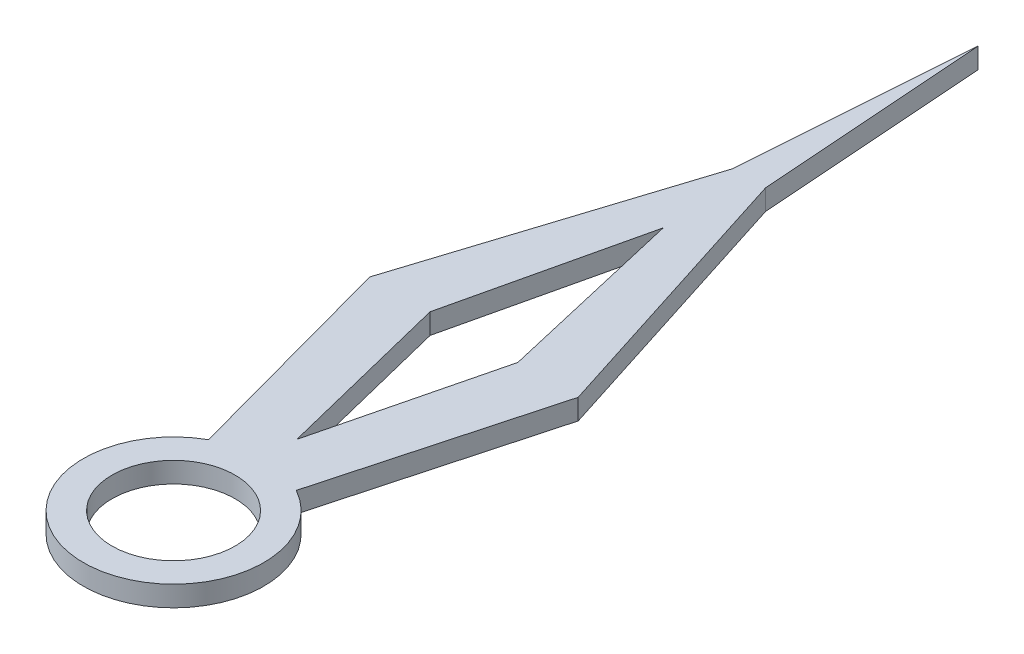
ISO-10303-21;
HEADER;
FILE_DESCRIPTION(('STEP AP214'),'2;1');
FILE_NAME('part.step','',(''),(''),'','','');
FILE_SCHEMA(('AUTOMOTIVE_DESIGN { 1 0 10303 214 1 1 1 1 }'));
ENDSEC;
DATA;
#1=APPLICATION_CONTEXT('core data for automotive mechanical design processes');
#2=APPLICATION_PROTOCOL_DEFINITION('international standard','automotive_design',2000,#1);
#3=PRODUCT_CONTEXT('',#1,'mechanical');
#4=PRODUCT('Part','Part','',(#3));
#5=PRODUCT_RELATED_PRODUCT_CATEGORY('part','',(#4));
#6=PRODUCT_DEFINITION_FORMATION('','',#4);
#7=PRODUCT_DEFINITION_CONTEXT('part definition',#1,'design');
#8=PRODUCT_DEFINITION('design','',#6,#7);
#9=PRODUCT_DEFINITION_SHAPE('','',#8);
#10=(LENGTH_UNIT() NAMED_UNIT(*) SI_UNIT(.MILLI.,.METRE.));
#11=(NAMED_UNIT(*) PLANE_ANGLE_UNIT() SI_UNIT($,.RADIAN.));
#12=(NAMED_UNIT(*) SI_UNIT($,.STERADIAN.) SOLID_ANGLE_UNIT());
#13=UNCERTAINTY_MEASURE_WITH_UNIT(LENGTH_MEASURE(1.E-05),#10,'distance_accuracy_value','');
#14=(GEOMETRIC_REPRESENTATION_CONTEXT(3) GLOBAL_UNCERTAINTY_ASSIGNED_CONTEXT((#13)) GLOBAL_UNIT_ASSIGNED_CONTEXT((#10,
#11,#12)) REPRESENTATION_CONTEXT('',''));
#15=CARTESIAN_POINT('',(0.,0.,0.));
#16=DIRECTION('',(0.,0.,1.));
#17=DIRECTION('',(1.,0.,0.));
#18=AXIS2_PLACEMENT_3D('',#15,#16,#17);
#19=CARTESIAN_POINT('',(-10.1750226421865,10.,2.77066259900445));
#20=DIRECTION('',(-0.964868301480339,0.,0.262734011499168));
#21=DIRECTION('',(0.262734011499168,0.,0.964868301480339));
#22=AXIS2_PLACEMENT_3D('',#19,#20,#21);
#23=PLANE('',#22);
#24=DIRECTION('',(-0.262734011499168,0.,-0.964868301480339));
#25=VECTOR('',#24,1.);
#26=CARTESIAN_POINT('',(-10.1750226421865,0.,2.77066259900445));
#27=LINE('',#26,#25);
#28=CARTESIAN_POINT('',(-21.3918568520725,0.,-38.4222066086182));
#29=VERTEX_POINT('',#28);
#30=CARTESIAN_POINT('',(-50.8100911545337,0.,-146.45816891895));
#31=VERTEX_POINT('',#30);
#32=EDGE_CURVE('E183',#29,#31,#27,.T.);
#33=ORIENTED_EDGE('',*,*,#32,.F.);
#34=DIRECTION('',(0.,-1.,0.));
#35=VECTOR('',#34,1.);
#36=CARTESIAN_POINT('',(-21.3918568520725,10.,-38.4222066086182));
#37=LINE('',#36,#35);
#38=CARTESIAN_POINT('',(-21.3918568520725,10.,-38.4222066086182));
#39=VERTEX_POINT('',#38);
#40=EDGE_CURVE('E11',#39,#29,#37,.T.);
#41=ORIENTED_EDGE('',*,*,#40,.F.);
#42=DIRECTION('',(-0.262734011499168,0.,-0.964868301480339));
#43=VECTOR('',#42,1.);
#44=CARTESIAN_POINT('',(-10.1750226421865,10.,2.77066259900445));
#45=LINE('',#44,#43);
#46=CARTESIAN_POINT('',(-50.8100911545337,10.,-146.45816891895));
#47=VERTEX_POINT('',#46);
#48=EDGE_CURVE('E305',#39,#47,#45,.T.);
#49=ORIENTED_EDGE('',*,*,#48,.T.);
#50=DIRECTION('',(0.,-1.,0.));
#51=VECTOR('',#50,1.);
#52=CARTESIAN_POINT('',(-50.8100911545337,10.,-146.45816891895));
#53=LINE('',#52,#51);
#54=EDGE_CURVE('E61',#47,#31,#53,.T.);
#55=ORIENTED_EDGE('',*,*,#54,.T.);
#56=EDGE_LOOP('',(#33,#41,#49,#55));
#57=FACE_BOUND('',#56,.T.);
#58=ADVANCED_FACE('F41',(#57),#23,.T.);
#59=CARTESIAN_POINT('',(0.,10.,0.));
#60=DIRECTION('',(0.,-1.,0.));
#61=DIRECTION('',(0.,0.,-1.));
#62=AXIS2_PLACEMENT_3D('',#59,#60,#61);
#63=CYLINDRICAL_SURFACE('',#62,43.9758740703912);
#64=CARTESIAN_POINT('',(0.,0.,0.));
#65=DIRECTION('',(0.,1.,0.));
#66=DIRECTION('',(0.,0.,1.));
#67=AXIS2_PLACEMENT_3D('',#64,#65,#66);
#68=CIRCLE('',#67,43.9758740703912);
#69=CARTESIAN_POINT('',(21.3918568520725,0.,-38.4222066086182));
#70=VERTEX_POINT('',#69);
#71=EDGE_CURVE('E186',#29,#70,#68,.T.);
#72=ORIENTED_EDGE('',*,*,#71,.T.);
#73=DIRECTION('',(0.,-1.,0.));
#74=VECTOR('',#73,1.);
#75=CARTESIAN_POINT('',(21.3918568520725,10.,-38.4222066086182));
#76=LINE('',#75,#74);
#77=CARTESIAN_POINT('',(21.3918568520725,10.,-38.4222066086182));
#78=VERTEX_POINT('',#77);
#79=EDGE_CURVE('E52',#78,#70,#76,.T.);
#80=ORIENTED_EDGE('',*,*,#79,.F.);
#81=CARTESIAN_POINT('',(0.,10.,0.));
#82=DIRECTION('',(0.,1.,0.));
#83=DIRECTION('',(0.,0.,1.));
#84=AXIS2_PLACEMENT_3D('',#81,#82,#83);
#85=CIRCLE('',#84,43.9758740703912);
#86=EDGE_CURVE('E301',#39,#78,#85,.T.);
#87=ORIENTED_EDGE('',*,*,#86,.F.);
#88=ORIENTED_EDGE('',*,*,#40,.T.);
#89=EDGE_LOOP('',(#72,#80,#87,#88));
#90=FACE_BOUND('',#89,.T.);
#91=ADVANCED_FACE('F260',(#90),#63,.T.);
#92=CARTESIAN_POINT('',(10.1750226421865,10.,2.77066259900445));
#93=DIRECTION('',(-0.964868301480339,0.,-0.262734011499168));
#94=DIRECTION('',(-0.262734011499168,0.,0.964868301480339));
#95=AXIS2_PLACEMENT_3D('',#92,#93,#94);
#96=PLANE('',#95);
#97=DIRECTION('',(0.262734011499168,0.,-0.964868301480339));
#98=VECTOR('',#97,1.);
#99=CARTESIAN_POINT('',(10.1750226421865,0.,2.77066259900445));
#100=LINE('',#99,#98);
#101=CARTESIAN_POINT('',(50.8100911545337,0.,-146.45816891895));
#102=VERTEX_POINT('',#101);
#103=EDGE_CURVE('E190',#70,#102,#100,.T.);
#104=ORIENTED_EDGE('',*,*,#103,.T.);
#105=DIRECTION('',(0.,-1.,0.));
#106=VECTOR('',#105,1.);
#107=CARTESIAN_POINT('',(50.8100911545337,10.,-146.45816891895));
#108=LINE('',#107,#106);
#109=CARTESIAN_POINT('',(50.8100911545337,10.,-146.45816891895));
#110=VERTEX_POINT('',#109);
#111=EDGE_CURVE('E214',#110,#102,#108,.T.);
#112=ORIENTED_EDGE('',*,*,#111,.F.);
#113=DIRECTION('',(0.262734011499168,0.,-0.964868301480339));
#114=VECTOR('',#113,1.);
#115=CARTESIAN_POINT('',(10.1750226421865,10.,2.77066259900445));
#116=LINE('',#115,#114);
#117=EDGE_CURVE('E298',#78,#110,#116,.T.);
#118=ORIENTED_EDGE('',*,*,#117,.F.);
#119=ORIENTED_EDGE('',*,*,#79,.T.);
#120=EDGE_LOOP('',(#104,#112,#118,#119));
#121=FACE_BOUND('',#120,.T.);
#122=ADVANCED_FACE('F265',(#121),#96,.F.);
#123=CARTESIAN_POINT('',(88.5109303475446,10.,-28.2228353498641));
#124=DIRECTION('',(-0.952738164581021,0.,0.303792675604249));
#125=DIRECTION('',(0.303792675604249,0.,0.952738164581021));
#126=AXIS2_PLACEMENT_3D('',#123,#124,#125);
#127=PLANE('',#126);
#128=DIRECTION('',(-0.303792675604249,0.,-0.952738164581021));
#129=VECTOR('',#128,1.);
#130=CARTESIAN_POINT('',(88.5109303475446,0.,-28.2228353498641));
#131=LINE('',#130,#129);
#132=CARTESIAN_POINT('',(8.04801112713444,0.,-280.566292355226));
#133=VERTEX_POINT('',#132);
#134=EDGE_CURVE('E194',#102,#133,#131,.T.);
#135=ORIENTED_EDGE('',*,*,#134,.T.);
#136=DIRECTION('',(0.,-1.,0.));
#137=VECTOR('',#136,1.);
#138=CARTESIAN_POINT('',(8.04801112713444,10.,-280.566292355226));
#139=LINE('',#138,#137);
#140=CARTESIAN_POINT('',(8.04801112713444,10.,-280.566292355226));
#141=VERTEX_POINT('',#140);
#142=EDGE_CURVE('E153',#141,#133,#139,.T.);
#143=ORIENTED_EDGE('',*,*,#142,.F.);
#144=DIRECTION('',(-0.303792675604249,0.,-0.952738164581021));
#145=VECTOR('',#144,1.);
#146=CARTESIAN_POINT('',(88.5109303475446,10.,-28.2228353498641));
#147=LINE('',#146,#145);
#148=EDGE_CURVE('E140',#110,#141,#147,.T.);
#149=ORIENTED_EDGE('',*,*,#148,.F.);
#150=ORIENTED_EDGE('',*,*,#111,.T.);
#151=EDGE_LOOP('',(#135,#143,#149,#150));
#152=FACE_BOUND('',#151,.T.);
#153=ADVANCED_FACE('F286',(#152),#127,.F.);
#154=CARTESIAN_POINT('',(28.1316777909964,10.,-2.02840353910531));
#155=DIRECTION('',(-0.997410606444127,0.,0.0719171895499227));
#156=DIRECTION('',(0.0719171895499227,0.,0.997410606444127));
#157=AXIS2_PLACEMENT_3D('',#154,#155,#156);
#158=PLANE('',#157);
#159=DIRECTION('',(-0.0719171895499227,0.,-0.997410606444127));
#160=VECTOR('',#159,1.);
#161=CARTESIAN_POINT('',(28.1316777909964,0.,-2.02840353910531));
#162=LINE('',#161,#160);
#163=CARTESIAN_POINT('',(0.,0.,-392.183163220459));
#164=VERTEX_POINT('',#163);
#165=EDGE_CURVE('E149',#133,#164,#162,.T.);
#166=ORIENTED_EDGE('',*,*,#165,.T.);
#167=DIRECTION('',(0.,-1.,0.));
#168=VECTOR('',#167,1.);
#169=CARTESIAN_POINT('',(0.,10.,-392.183163220459));
#170=LINE('',#169,#168);
#171=CARTESIAN_POINT('',(0.,10.,-392.183163220459));
#172=VERTEX_POINT('',#171);
#173=EDGE_CURVE('E147',#172,#164,#170,.T.);
#174=ORIENTED_EDGE('',*,*,#173,.F.);
#175=DIRECTION('',(-0.0719171895499227,0.,-0.997410606444127));
#176=VECTOR('',#175,1.);
#177=CARTESIAN_POINT('',(28.1316777909964,10.,-2.02840353910531));
#178=LINE('',#177,#176);
#179=EDGE_CURVE('E132',#141,#172,#178,.T.);
#180=ORIENTED_EDGE('',*,*,#179,.F.);
#181=ORIENTED_EDGE('',*,*,#142,.T.);
#182=EDGE_LOOP('',(#166,#174,#180,#181));
#183=FACE_BOUND('',#182,.T.);
#184=ADVANCED_FACE('F148',(#183),#158,.F.);
#185=CARTESIAN_POINT('',(-28.1316777909964,10.,-2.02840353910531));
#186=DIRECTION('',(-0.997410606444127,0.,-0.0719171895499227));
#187=DIRECTION('',(-0.0719171895499227,0.,0.997410606444127));
#188=AXIS2_PLACEMENT_3D('',#185,#186,#187);
#189=PLANE('',#188);
#190=DIRECTION('',(0.0719171895499227,0.,-0.997410606444127));
#191=VECTOR('',#190,1.);
#192=CARTESIAN_POINT('',(-28.1316777909964,0.,-2.02840353910531));
#193=LINE('',#192,#191);
#194=CARTESIAN_POINT('',(-8.04801112713442,0.,-280.566292355226));
#195=VERTEX_POINT('',#194);
#196=EDGE_CURVE('E200',#195,#164,#193,.T.);
#197=ORIENTED_EDGE('',*,*,#196,.F.);
#198=DIRECTION('',(0.,-1.,0.));
#199=VECTOR('',#198,1.);
#200=CARTESIAN_POINT('',(-8.04801112713442,10.,-280.566292355226));
#201=LINE('',#200,#199);
#202=CARTESIAN_POINT('',(-8.04801112713442,10.,-280.566292355226));
#203=VERTEX_POINT('',#202);
#204=EDGE_CURVE('E95',#203,#195,#201,.T.);
#205=ORIENTED_EDGE('',*,*,#204,.F.);
#206=DIRECTION('',(0.0719171895499227,0.,-0.997410606444127));
#207=VECTOR('',#206,1.);
#208=CARTESIAN_POINT('',(-28.1316777909964,10.,-2.02840353910531));
#209=LINE('',#208,#207);
#210=EDGE_CURVE('E138',#203,#172,#209,.T.);
#211=ORIENTED_EDGE('',*,*,#210,.T.);
#212=ORIENTED_EDGE('',*,*,#173,.T.);
#213=EDGE_LOOP('',(#197,#205,#211,#212));
#214=FACE_BOUND('',#213,.T.);
#215=ADVANCED_FACE('F155',(#214),#189,.T.);
#216=CARTESIAN_POINT('',(-52.5206473706477,10.,-12.1750544461166));
#217=DIRECTION('',(0.974167584645076,0.,0.225826298350698));
#218=DIRECTION('',(0.225826298350698,0.,-0.974167584645076));
#219=AXIS2_PLACEMENT_3D('',#216,#217,#218);
#220=PLANE('',#219);
#221=DIRECTION('',(-0.225826298350698,0.,0.974167584645076));
#222=VECTOR('',#221,1.);
#223=CARTESIAN_POINT('',(-52.5206473706477,0.,-12.1750544461166));
#224=LINE('',#223,#222);
#225=CARTESIAN_POINT('',(0.,0.,-238.73818091425));
#226=VERTEX_POINT('',#225);
#227=CARTESIAN_POINT('',(-21.3918568520725,0.,-146.45816891895));
#228=VERTEX_POINT('',#227);
#229=EDGE_CURVE('E164',#226,#228,#224,.T.);
#230=ORIENTED_EDGE('',*,*,#229,.F.);
#231=DIRECTION('',(0.,-1.,0.));
#232=VECTOR('',#231,1.);
#233=CARTESIAN_POINT('',(0.,10.,-238.73818091425));
#234=LINE('',#233,#232);
#235=CARTESIAN_POINT('',(0.,10.,-238.73818091425));
#236=VERTEX_POINT('',#235);
#237=EDGE_CURVE('E45',#236,#226,#234,.T.);
#238=ORIENTED_EDGE('',*,*,#237,.F.);
#239=DIRECTION('',(-0.225826298350698,0.,0.974167584645076));
#240=VECTOR('',#239,1.);
#241=CARTESIAN_POINT('',(-52.5206473706477,10.,-12.1750544461166));
#242=LINE('',#241,#240);
#243=CARTESIAN_POINT('',(-21.3918568520725,10.,-146.45816891895));
#244=VERTEX_POINT('',#243);
#245=EDGE_CURVE('E207',#236,#244,#242,.T.);
#246=ORIENTED_EDGE('',*,*,#245,.T.);
#247=DIRECTION('',(0.,-1.,0.));
#248=VECTOR('',#247,1.);
#249=CARTESIAN_POINT('',(-21.3918568520725,10.,-146.45816891895));
#250=LINE('',#249,#248);
#251=EDGE_CURVE('E160',#244,#228,#250,.T.);
#252=ORIENTED_EDGE('',*,*,#251,.T.);
#253=EDGE_LOOP('',(#230,#238,#246,#252));
#254=FACE_BOUND('',#253,.T.);
#255=ADVANCED_FACE('F43',(#254),#220,.T.);
#256=CARTESIAN_POINT('',(52.5206473706477,10.,-12.1750544461166));
#257=DIRECTION('',(0.974167584645076,0.,-0.225826298350698));
#258=DIRECTION('',(-0.225826298350698,0.,-0.974167584645076));
#259=AXIS2_PLACEMENT_3D('',#256,#257,#258);
#260=PLANE('',#259);
#261=DIRECTION('',(0.225826298350698,0.,0.974167584645076));
#262=VECTOR('',#261,1.);
#263=CARTESIAN_POINT('',(52.5206473706477,0.,-12.1750544461166));
#264=LINE('',#263,#262);
#265=CARTESIAN_POINT('',(21.3918568520725,0.,-146.45816891895));
#266=VERTEX_POINT('',#265);
#267=EDGE_CURVE('E168',#226,#266,#264,.T.);
#268=ORIENTED_EDGE('',*,*,#267,.T.);
#269=DIRECTION('',(0.,-1.,0.));
#270=VECTOR('',#269,1.);
#271=CARTESIAN_POINT('',(21.3918568520725,10.,-146.45816891895));
#272=LINE('',#271,#270);
#273=CARTESIAN_POINT('',(21.3918568520725,10.,-146.45816891895));
#274=VERTEX_POINT('',#273);
#275=EDGE_CURVE('E225',#274,#266,#272,.T.);
#276=ORIENTED_EDGE('',*,*,#275,.F.);
#277=DIRECTION('',(0.225826298350698,0.,0.974167584645076));
#278=VECTOR('',#277,1.);
#279=CARTESIAN_POINT('',(52.5206473706477,10.,-12.1750544461166));
#280=LINE('',#279,#278);
#281=EDGE_CURVE('E236',#236,#274,#280,.T.);
#282=ORIENTED_EDGE('',*,*,#281,.F.);
#283=ORIENTED_EDGE('',*,*,#237,.T.);
#284=EDGE_LOOP('',(#268,#276,#282,#283));
#285=FACE_BOUND('',#284,.T.);
#286=ADVANCED_FACE('F235',(#285),#260,.F.);
#287=CARTESIAN_POINT('',(-14.018338295055,10.,-3.47159944097268));
#288=DIRECTION('',(0.970677531015817,0.,0.240385379715651));
#289=DIRECTION('',(0.240385379715651,0.,-0.970677531015817));
#290=AXIS2_PLACEMENT_3D('',#287,#288,#289);
#291=PLANE('',#290);
#292=DIRECTION('',(-0.240385379715651,0.,0.970677531015817));
#293=VECTOR('',#292,1.);
#294=CARTESIAN_POINT('',(-14.018338295055,0.,-3.47159944097268));
#295=LINE('',#294,#293);
#296=CARTESIAN_POINT('',(0.,0.,-60.0777292367378));
#297=VERTEX_POINT('',#296);
#298=EDGE_CURVE('E171',#266,#297,#295,.T.);
#299=ORIENTED_EDGE('',*,*,#298,.T.);
#300=DIRECTION('',(0.,-1.,0.));
#301=VECTOR('',#300,1.);
#302=CARTESIAN_POINT('',(0.,10.,-60.0777292367378));
#303=LINE('',#302,#301);
#304=CARTESIAN_POINT('',(0.,10.,-60.0777292367378));
#305=VERTEX_POINT('',#304);
#306=EDGE_CURVE('E223',#305,#297,#303,.T.);
#307=ORIENTED_EDGE('',*,*,#306,.F.);
#308=DIRECTION('',(-0.240385379715651,0.,0.970677531015817));
#309=VECTOR('',#308,1.);
#310=CARTESIAN_POINT('',(-14.018338295055,10.,-3.47159944097268));
#311=LINE('',#310,#309);
#312=EDGE_CURVE('E316',#274,#305,#311,.T.);
#313=ORIENTED_EDGE('',*,*,#312,.F.);
#314=ORIENTED_EDGE('',*,*,#275,.T.);
#315=EDGE_LOOP('',(#299,#307,#313,#314));
#316=FACE_BOUND('',#315,.T.);
#317=ADVANCED_FACE('F248',(#316),#291,.F.);
#318=CARTESIAN_POINT('',(0.,10.,0.));
#319=DIRECTION('',(0.,-1.,0.));
#320=DIRECTION('',(0.,0.,-1.));
#321=AXIS2_PLACEMENT_3D('',#318,#319,#320);
#322=CYLINDRICAL_SURFACE('',#321,30.);
#323=CARTESIAN_POINT('',(0.,10.,0.));
#324=DIRECTION('',(0.,1.,0.));
#325=DIRECTION('',(0.,0.,1.));
#326=AXIS2_PLACEMENT_3D('',#323,#324,#325);
#327=CIRCLE('',#326,30.);
#328=CARTESIAN_POINT('',(0.,10.,30.));
#329=VERTEX_POINT('',#328);
#330=EDGE_CURVE('E310',#329,#329,#327,.T.);
#331=ORIENTED_EDGE('',*,*,#330,.T.);
#332=EDGE_LOOP('',(#331));
#333=FACE_BOUND('',#332,.T.);
#334=CARTESIAN_POINT('',(0.,0.,0.));
#335=DIRECTION('',(0.,1.,0.));
#336=DIRECTION('',(0.,0.,1.));
#337=AXIS2_PLACEMENT_3D('',#334,#335,#336);
#338=CIRCLE('',#337,30.);
#339=CARTESIAN_POINT('',(0.,0.,30.));
#340=VERTEX_POINT('',#339);
#341=EDGE_CURVE('E179',#340,#340,#338,.T.);
#342=ORIENTED_EDGE('',*,*,#341,.F.);
#343=EDGE_LOOP('',(#342));
#344=FACE_BOUND('',#343,.T.);
#345=ADVANCED_FACE('F250',(#333,#344),#322,.F.);
#346=CARTESIAN_POINT('',(14.018338295055,10.,-3.47159944097268));
#347=DIRECTION('',(0.970677531015817,0.,-0.240385379715651));
#348=DIRECTION('',(-0.240385379715651,0.,-0.970677531015817));
#349=AXIS2_PLACEMENT_3D('',#346,#347,#348);
#350=PLANE('',#349);
#351=DIRECTION('',(0.240385379715651,0.,0.970677531015817));
#352=VECTOR('',#351,1.);
#353=CARTESIAN_POINT('',(14.018338295055,0.,-3.47159944097268));
#354=LINE('',#353,#352);
#355=EDGE_CURVE('E175',#228,#297,#354,.T.);
#356=ORIENTED_EDGE('',*,*,#355,.F.);
#357=ORIENTED_EDGE('',*,*,#251,.F.);
#358=DIRECTION('',(0.240385379715651,0.,0.970677531015817));
#359=VECTOR('',#358,1.);
#360=CARTESIAN_POINT('',(14.018338295055,10.,-3.47159944097268));
#361=LINE('',#360,#359);
#362=EDGE_CURVE('E246',#244,#305,#361,.T.);
#363=ORIENTED_EDGE('',*,*,#362,.T.);
#364=ORIENTED_EDGE('',*,*,#306,.T.);
#365=EDGE_LOOP('',(#356,#357,#363,#364));
#366=FACE_BOUND('',#365,.T.);
#367=ADVANCED_FACE('F245',(#366),#350,.T.);
#368=CARTESIAN_POINT('',(-88.5109303475446,10.,-28.2228353498641));
#369=DIRECTION('',(-0.952738164581021,0.,-0.303792675604249));
#370=DIRECTION('',(-0.303792675604249,0.,0.952738164581021));
#371=AXIS2_PLACEMENT_3D('',#368,#369,#370);
#372=PLANE('',#371);
#373=DIRECTION('',(0.303792675604249,0.,-0.952738164581021));
#374=VECTOR('',#373,1.);
#375=CARTESIAN_POINT('',(-88.5109303475446,0.,-28.2228353498641));
#376=LINE('',#375,#374);
#377=EDGE_CURVE('E203',#31,#195,#376,.T.);
#378=ORIENTED_EDGE('',*,*,#377,.F.);
#379=ORIENTED_EDGE('',*,*,#54,.F.);
#380=DIRECTION('',(0.303792675604249,0.,-0.952738164581021));
#381=VECTOR('',#380,1.);
#382=CARTESIAN_POINT('',(-88.5109303475446,10.,-28.2228353498641));
#383=LINE('',#382,#381);
#384=EDGE_CURVE('E157',#47,#203,#383,.T.);
#385=ORIENTED_EDGE('',*,*,#384,.T.);
#386=ORIENTED_EDGE('',*,*,#204,.T.);
#387=EDGE_LOOP('',(#378,#379,#385,#386));
#388=FACE_BOUND('',#387,.T.);
#389=ADVANCED_FACE('F270',(#388),#372,.T.);
#390=CARTESIAN_POINT('',(0.,10.,0.));
#391=DIRECTION('',(0.,1.,0.));
#392=DIRECTION('',(0.,0.,1.));
#393=AXIS2_PLACEMENT_3D('',#390,#391,#392);
#394=PLANE('',#393);
#395=ORIENTED_EDGE('',*,*,#245,.F.);
#396=ORIENTED_EDGE('',*,*,#281,.T.);
#397=ORIENTED_EDGE('',*,*,#312,.T.);
#398=ORIENTED_EDGE('',*,*,#362,.F.);
#399=EDGE_LOOP('',(#395,#396,#397,#398));
#400=FACE_BOUND('',#399,.T.);
#401=ORIENTED_EDGE('',*,*,#330,.F.);
#402=EDGE_LOOP('',(#401));
#403=FACE_BOUND('',#402,.T.);
#404=ORIENTED_EDGE('',*,*,#48,.F.);
#405=ORIENTED_EDGE('',*,*,#86,.T.);
#406=ORIENTED_EDGE('',*,*,#117,.T.);
#407=ORIENTED_EDGE('',*,*,#148,.T.);
#408=ORIENTED_EDGE('',*,*,#179,.T.);
#409=ORIENTED_EDGE('',*,*,#210,.F.);
#410=ORIENTED_EDGE('',*,*,#384,.F.);
#411=EDGE_LOOP('',(#404,#405,#406,#407,#408,#409,#410));
#412=FACE_BOUND('',#411,.T.);
#413=ADVANCED_FACE('F135',(#400,#403,#412),#394,.T.);
#414=CARTESIAN_POINT('',(0.,0.,0.));
#415=DIRECTION('',(0.,1.,0.));
#416=DIRECTION('',(0.,0.,1.));
#417=AXIS2_PLACEMENT_3D('',#414,#415,#416);
#418=PLANE('',#417);
#419=ORIENTED_EDGE('',*,*,#229,.T.);
#420=ORIENTED_EDGE('',*,*,#355,.T.);
#421=ORIENTED_EDGE('',*,*,#298,.F.);
#422=ORIENTED_EDGE('',*,*,#267,.F.);
#423=EDGE_LOOP('',(#419,#420,#421,#422));
#424=FACE_BOUND('',#423,.T.);
#425=ORIENTED_EDGE('',*,*,#341,.T.);
#426=EDGE_LOOP('',(#425));
#427=FACE_BOUND('',#426,.T.);
#428=ORIENTED_EDGE('',*,*,#32,.T.);
#429=ORIENTED_EDGE('',*,*,#377,.T.);
#430=ORIENTED_EDGE('',*,*,#196,.T.);
#431=ORIENTED_EDGE('',*,*,#165,.F.);
#432=ORIENTED_EDGE('',*,*,#134,.F.);
#433=ORIENTED_EDGE('',*,*,#103,.F.);
#434=ORIENTED_EDGE('',*,*,#71,.F.);
#435=EDGE_LOOP('',(#428,#429,#430,#431,#432,#433,#434));
#436=FACE_BOUND('',#435,.T.);
#437=ADVANCED_FACE('F239',(#424,#427,#436),#418,.F.);
#438=CLOSED_SHELL('',(#58,#91,#122,#153,#184,#215,#255,#286,#317,#345,#367,#389,#413,#437));
#439=MANIFOLD_SOLID_BREP('B2',#438);
#440=ADVANCED_BREP_SHAPE_REPRESENTATION('',(#18,#439),#14);
#441=SHAPE_DEFINITION_REPRESENTATION(#9,#440);
ENDSEC;
END-ISO-10303-21;
